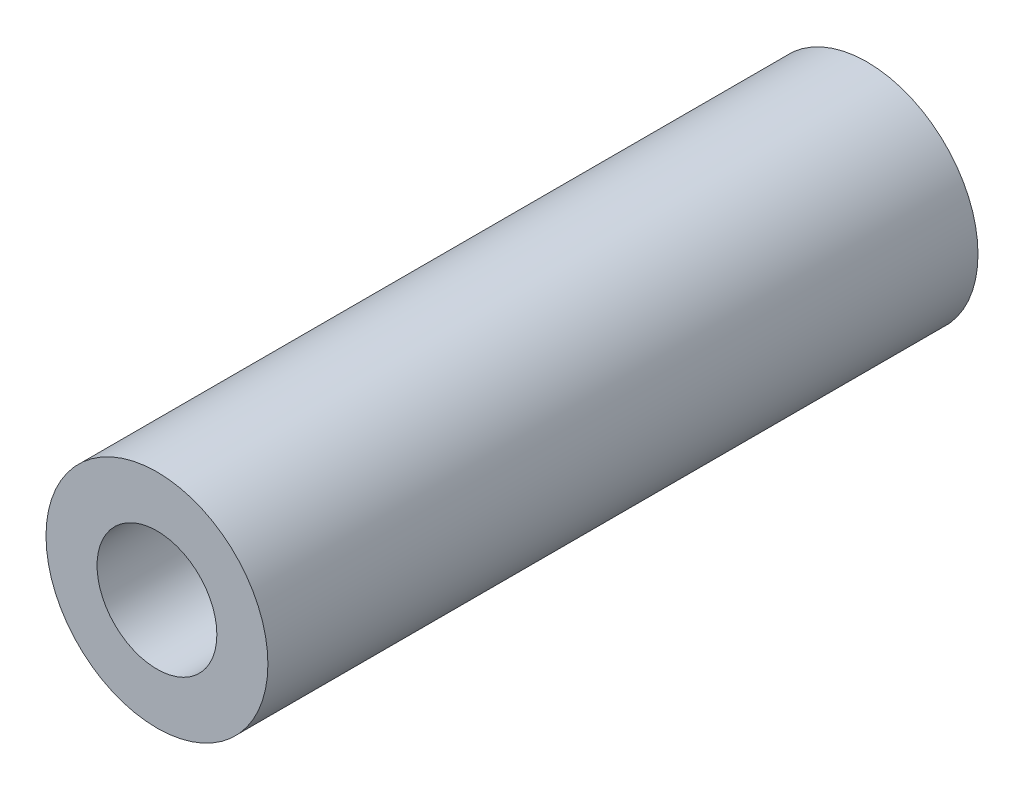
ISO-10303-21;
HEADER;
FILE_DESCRIPTION(('STEP AP214'),'2;1');
FILE_NAME('part.step','',(''),(''),'','','');
FILE_SCHEMA(('AUTOMOTIVE_DESIGN { 1 0 10303 214 1 1 1 1 }'));
ENDSEC;
DATA;
#1=APPLICATION_CONTEXT('core data for automotive mechanical design processes');
#2=APPLICATION_PROTOCOL_DEFINITION('international standard','automotive_design',2000,#1);
#3=PRODUCT_CONTEXT('',#1,'mechanical');
#4=PRODUCT('Part','Part','',(#3));
#5=PRODUCT_RELATED_PRODUCT_CATEGORY('part','',(#4));
#6=PRODUCT_DEFINITION_FORMATION('','',#4);
#7=PRODUCT_DEFINITION_CONTEXT('part definition',#1,'design');
#8=PRODUCT_DEFINITION('design','',#6,#7);
#9=PRODUCT_DEFINITION_SHAPE('','',#8);
#10=(LENGTH_UNIT() NAMED_UNIT(*) SI_UNIT(.MILLI.,.METRE.));
#11=(NAMED_UNIT(*) PLANE_ANGLE_UNIT() SI_UNIT($,.RADIAN.));
#12=(NAMED_UNIT(*) SI_UNIT($,.STERADIAN.) SOLID_ANGLE_UNIT());
#13=UNCERTAINTY_MEASURE_WITH_UNIT(LENGTH_MEASURE(1.E-05),#10,'distance_accuracy_value','');
#14=(GEOMETRIC_REPRESENTATION_CONTEXT(3) GLOBAL_UNCERTAINTY_ASSIGNED_CONTEXT((#13)) GLOBAL_UNIT_ASSIGNED_CONTEXT((#10,
#11,#12)) REPRESENTATION_CONTEXT('',''));
#15=CARTESIAN_POINT('',(0.,0.,0.));
#16=DIRECTION('',(0.,0.,1.));
#17=DIRECTION('',(1.,0.,0.));
#18=AXIS2_PLACEMENT_3D('',#15,#16,#17);
#19=CARTESIAN_POINT('',(0.,0.,16.));
#20=DIRECTION('',(0.,0.,1.));
#21=DIRECTION('',(1.,0.,0.));
#22=AXIS2_PLACEMENT_3D('',#19,#20,#21);
#23=PLANE('',#22);
#24=CARTESIAN_POINT('',(0.,0.,16.));
#25=DIRECTION('',(0.,0.,1.));
#26=DIRECTION('',(1.,0.,0.));
#27=AXIS2_PLACEMENT_3D('',#24,#25,#26);
#28=CIRCLE('',#27,2.5);
#29=CARTESIAN_POINT('',(2.5,0.,16.));
#30=VERTEX_POINT('',#29);
#31=EDGE_CURVE('E10',#30,#30,#28,.T.);
#32=ORIENTED_EDGE('',*,*,#31,.T.);
#33=EDGE_LOOP('',(#32));
#34=FACE_BOUND('',#33,.T.);
#35=CARTESIAN_POINT('',(0.,0.,16.));
#36=DIRECTION('',(0.,0.,1.));
#37=DIRECTION('',(1.,0.,0.));
#38=AXIS2_PLACEMENT_3D('',#35,#36,#37);
#39=CIRCLE('',#38,1.35);
#40=CARTESIAN_POINT('',(1.35,0.,16.));
#41=VERTEX_POINT('',#40);
#42=EDGE_CURVE('E41',#41,#41,#39,.T.);
#43=ORIENTED_EDGE('',*,*,#42,.F.);
#44=EDGE_LOOP('',(#43));
#45=FACE_BOUND('',#44,.T.);
#46=ADVANCED_FACE('F30',(#34,#45),#23,.T.);
#47=CARTESIAN_POINT('',(0.,0.,0.));
#48=DIRECTION('',(0.,0.,1.));
#49=DIRECTION('',(1.,0.,0.));
#50=AXIS2_PLACEMENT_3D('',#47,#48,#49);
#51=PLANE('',#50);
#52=CARTESIAN_POINT('',(0.,0.,0.));
#53=DIRECTION('',(0.,0.,1.));
#54=DIRECTION('',(1.,0.,0.));
#55=AXIS2_PLACEMENT_3D('',#52,#53,#54);
#56=CIRCLE('',#55,2.5);
#57=CARTESIAN_POINT('',(2.5,0.,0.));
#58=VERTEX_POINT('',#57);
#59=EDGE_CURVE('E34',#58,#58,#56,.T.);
#60=ORIENTED_EDGE('',*,*,#59,.F.);
#61=EDGE_LOOP('',(#60));
#62=FACE_BOUND('',#61,.T.);
#63=CARTESIAN_POINT('',(0.,0.,0.));
#64=DIRECTION('',(0.,0.,1.));
#65=DIRECTION('',(1.,0.,0.));
#66=AXIS2_PLACEMENT_3D('',#63,#64,#65);
#67=CIRCLE('',#66,1.35);
#68=CARTESIAN_POINT('',(1.35,0.,0.));
#69=VERTEX_POINT('',#68);
#70=EDGE_CURVE('E43',#69,#69,#67,.T.);
#71=ORIENTED_EDGE('',*,*,#70,.T.);
#72=EDGE_LOOP('',(#71));
#73=FACE_BOUND('',#72,.T.);
#74=ADVANCED_FACE('F53',(#62,#73),#51,.F.);
#75=CARTESIAN_POINT('',(0.,0.,16.));
#76=DIRECTION('',(0.,0.,-1.));
#77=DIRECTION('',(-1.,0.,0.));
#78=AXIS2_PLACEMENT_3D('',#75,#76,#77);
#79=CYLINDRICAL_SURFACE('',#78,2.5);
#80=ORIENTED_EDGE('',*,*,#31,.F.);
#81=EDGE_LOOP('',(#80));
#82=FACE_BOUND('',#81,.T.);
#83=ORIENTED_EDGE('',*,*,#59,.T.);
#84=EDGE_LOOP('',(#83));
#85=FACE_BOUND('',#84,.T.);
#86=ADVANCED_FACE('F32',(#82,#85),#79,.T.);
#87=CARTESIAN_POINT('',(0.,0.,16.));
#88=DIRECTION('',(0.,0.,-1.));
#89=DIRECTION('',(-1.,0.,0.));
#90=AXIS2_PLACEMENT_3D('',#87,#88,#89);
#91=CYLINDRICAL_SURFACE('',#90,1.35);
#92=ORIENTED_EDGE('',*,*,#42,.T.);
#93=EDGE_LOOP('',(#92));
#94=FACE_BOUND('',#93,.T.);
#95=ORIENTED_EDGE('',*,*,#70,.F.);
#96=EDGE_LOOP('',(#95));
#97=FACE_BOUND('',#96,.T.);
#98=ADVANCED_FACE('F49',(#94,#97),#91,.F.);
#99=CLOSED_SHELL('',(#46,#74,#86,#98));
#100=MANIFOLD_SOLID_BREP('B2',#99);
#101=ADVANCED_BREP_SHAPE_REPRESENTATION('',(#18,#100),#14);
#102=SHAPE_DEFINITION_REPRESENTATION(#9,#101);
ENDSEC;
END-ISO-10303-21;
